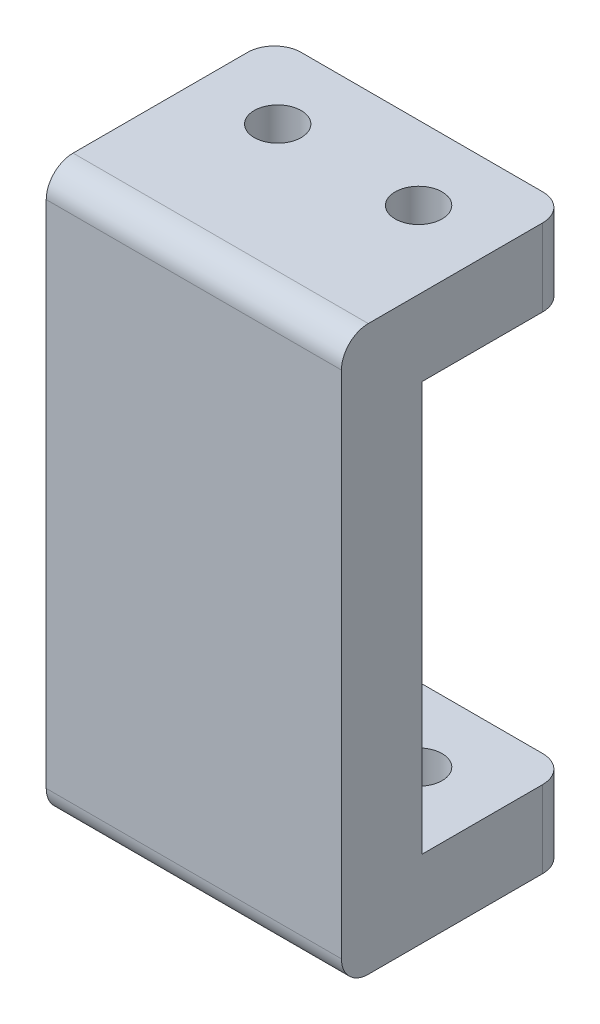
ISO-10303-21;
HEADER;
FILE_DESCRIPTION(('STEP AP214'),'2;1');
FILE_NAME('part.step','',(''),(''),'','','');
FILE_SCHEMA(('AUTOMOTIVE_DESIGN { 1 0 10303 214 1 1 1 1 }'));
ENDSEC;
DATA;
#1=APPLICATION_CONTEXT('core data for automotive mechanical design processes');
#2=APPLICATION_PROTOCOL_DEFINITION('international standard','automotive_design',2000,#1);
#3=PRODUCT_CONTEXT('',#1,'mechanical');
#4=PRODUCT('Part','Part','',(#3));
#5=PRODUCT_RELATED_PRODUCT_CATEGORY('part','',(#4));
#6=PRODUCT_DEFINITION_FORMATION('','',#4);
#7=PRODUCT_DEFINITION_CONTEXT('part definition',#1,'design');
#8=PRODUCT_DEFINITION('design','',#6,#7);
#9=PRODUCT_DEFINITION_SHAPE('','',#8);
#10=(LENGTH_UNIT() NAMED_UNIT(*) SI_UNIT(.MILLI.,.METRE.));
#11=(NAMED_UNIT(*) PLANE_ANGLE_UNIT() SI_UNIT($,.RADIAN.));
#12=(NAMED_UNIT(*) SI_UNIT($,.STERADIAN.) SOLID_ANGLE_UNIT());
#13=UNCERTAINTY_MEASURE_WITH_UNIT(LENGTH_MEASURE(1.E-05),#10,'distance_accuracy_value','');
#14=(GEOMETRIC_REPRESENTATION_CONTEXT(3) GLOBAL_UNCERTAINTY_ASSIGNED_CONTEXT((#13)) GLOBAL_UNIT_ASSIGNED_CONTEXT((#10,
#11,#12)) REPRESENTATION_CONTEXT('',''));
#15=CARTESIAN_POINT('',(0.,0.,0.));
#16=DIRECTION('',(0.,0.,1.));
#17=DIRECTION('',(1.,0.,0.));
#18=AXIS2_PLACEMENT_3D('',#15,#16,#17);
#19=CARTESIAN_POINT('',(0.,42.,-5.5));
#20=DIRECTION('',(0.,0.,-1.));
#21=DIRECTION('',(-1.,0.,0.));
#22=AXIS2_PLACEMENT_3D('',#19,#20,#21);
#23=PLANE('',#22);
#24=DIRECTION('',(1.,0.,0.));
#25=VECTOR('',#24,1.);
#26=CARTESIAN_POINT('',(0.,0.,-5.5));
#27=LINE('',#26,#25);
#28=CARTESIAN_POINT('',(-9.,0.,-5.5));
#29=VERTEX_POINT('',#28);
#30=CARTESIAN_POINT('',(9.,0.,-5.5));
#31=VERTEX_POINT('',#30);
#32=EDGE_CURVE('E207',#29,#31,#27,.T.);
#33=ORIENTED_EDGE('',*,*,#32,.F.);
#34=DIRECTION('',(0.,-1.,0.));
#35=VECTOR('',#34,1.);
#36=CARTESIAN_POINT('',(-9.,5.75,-5.5));
#37=LINE('',#36,#35);
#38=CARTESIAN_POINT('',(-9.,5.75,-5.5));
#39=VERTEX_POINT('',#38);
#40=EDGE_CURVE('E246',#29,#39,#37,.F.);
#41=ORIENTED_EDGE('',*,*,#40,.T.);
#42=DIRECTION('',(-1.,0.,0.));
#43=VECTOR('',#42,1.);
#44=CARTESIAN_POINT('',(11.,5.75,-5.5));
#45=LINE('',#44,#43);
#46=CARTESIAN_POINT('',(9.,5.75,-5.5));
#47=VERTEX_POINT('',#46);
#48=EDGE_CURVE('E176',#47,#39,#45,.T.);
#49=ORIENTED_EDGE('',*,*,#48,.F.);
#50=DIRECTION('',(0.,-1.,0.));
#51=VECTOR('',#50,1.);
#52=CARTESIAN_POINT('',(9.,42.,-5.5));
#53=LINE('',#52,#51);
#54=EDGE_CURVE('E243',#47,#31,#53,.T.);
#55=ORIENTED_EDGE('',*,*,#54,.T.);
#56=EDGE_LOOP('',(#33,#41,#49,#55));
#57=FACE_BOUND('',#56,.T.);
#58=ADVANCED_FACE('F37',(#57),#23,.T.);
#59=CARTESIAN_POINT('',(5.25,42.,0.));
#60=DIRECTION('',(0.,-1.,0.));
#61=DIRECTION('',(0.,0.,-1.));
#62=AXIS2_PLACEMENT_3D('',#59,#60,#61);
#63=CYLINDRICAL_SURFACE('',#62,1.75);
#64=CARTESIAN_POINT('',(5.25,5.75,0.));
#65=DIRECTION('',(0.,-1.,0.));
#66=DIRECTION('',(0.,0.,-1.));
#67=AXIS2_PLACEMENT_3D('',#64,#65,#66);
#68=CIRCLE('',#67,1.75);
#69=CARTESIAN_POINT('',(5.25,5.75,-1.75));
#70=VERTEX_POINT('',#69);
#71=EDGE_CURVE('E185',#70,#70,#68,.T.);
#72=ORIENTED_EDGE('',*,*,#71,.F.);
#73=EDGE_LOOP('',(#72));
#74=FACE_BOUND('',#73,.T.);
#75=CARTESIAN_POINT('',(5.25,0.,0.));
#76=DIRECTION('',(0.,1.,0.));
#77=DIRECTION('',(0.,0.,1.));
#78=AXIS2_PLACEMENT_3D('',#75,#76,#77);
#79=CIRCLE('',#78,1.75);
#80=CARTESIAN_POINT('',(5.25,0.,1.75));
#81=VERTEX_POINT('',#80);
#82=EDGE_CURVE('E213',#81,#81,#79,.T.);
#83=ORIENTED_EDGE('',*,*,#82,.F.);
#84=EDGE_LOOP('',(#83));
#85=FACE_BOUND('',#84,.T.);
#86=ADVANCED_FACE('F310',(#74,#85),#63,.F.);
#87=CARTESIAN_POINT('',(-5.25,42.,0.));
#88=DIRECTION('',(0.,-1.,0.));
#89=DIRECTION('',(0.,0.,-1.));
#90=AXIS2_PLACEMENT_3D('',#87,#88,#89);
#91=CYLINDRICAL_SURFACE('',#90,1.75);
#92=CARTESIAN_POINT('',(-5.25,5.75,0.));
#93=DIRECTION('',(0.,-1.,0.));
#94=DIRECTION('',(0.,0.,-1.));
#95=AXIS2_PLACEMENT_3D('',#92,#93,#94);
#96=CIRCLE('',#95,1.75);
#97=CARTESIAN_POINT('',(-5.25,5.75,-1.75));
#98=VERTEX_POINT('',#97);
#99=EDGE_CURVE('E184',#98,#98,#96,.T.);
#100=ORIENTED_EDGE('',*,*,#99,.F.);
#101=EDGE_LOOP('',(#100));
#102=FACE_BOUND('',#101,.T.);
#103=CARTESIAN_POINT('',(-5.25,0.,0.));
#104=DIRECTION('',(0.,1.,0.));
#105=DIRECTION('',(0.,0.,1.));
#106=AXIS2_PLACEMENT_3D('',#103,#104,#105);
#107=CIRCLE('',#106,1.75);
#108=CARTESIAN_POINT('',(-5.25,0.,1.75));
#109=VERTEX_POINT('',#108);
#110=EDGE_CURVE('E193',#109,#109,#107,.T.);
#111=ORIENTED_EDGE('',*,*,#110,.F.);
#112=EDGE_LOOP('',(#111));
#113=FACE_BOUND('',#112,.T.);
#114=ADVANCED_FACE('F316',(#102,#113),#91,.F.);
#115=CARTESIAN_POINT('',(11.,42.,0.));
#116=DIRECTION('',(1.,0.,0.));
#117=DIRECTION('',(0.,0.,-1.));
#118=AXIS2_PLACEMENT_3D('',#115,#116,#117);
#119=PLANE('',#118);
#120=DIRECTION('',(0.,0.,1.));
#121=VECTOR('',#120,1.);
#122=CARTESIAN_POINT('',(11.,0.,0.));
#123=LINE('',#122,#121);
#124=CARTESIAN_POINT('',(11.,0.,-3.5));
#125=VERTEX_POINT('',#124);
#126=CARTESIAN_POINT('',(11.,0.,9.5));
#127=VERTEX_POINT('',#126);
#128=EDGE_CURVE('E188',#125,#127,#123,.T.);
#129=ORIENTED_EDGE('',*,*,#128,.F.);
#130=DIRECTION('',(0.,-1.,0.));
#131=VECTOR('',#130,1.);
#132=CARTESIAN_POINT('',(11.,42.,-3.5));
#133=LINE('',#132,#131);
#134=CARTESIAN_POINT('',(11.,5.75,-3.5));
#135=VERTEX_POINT('',#134);
#136=EDGE_CURVE('E258',#125,#135,#133,.F.);
#137=ORIENTED_EDGE('',*,*,#136,.T.);
#138=DIRECTION('',(0.,0.,-1.));
#139=VECTOR('',#138,1.);
#140=CARTESIAN_POINT('',(11.,5.75,49.1065153929475));
#141=LINE('',#140,#139);
#142=CARTESIAN_POINT('',(11.,5.75000000000001,5.5));
#143=VERTEX_POINT('',#142);
#144=EDGE_CURVE('E149',#143,#135,#141,.T.);
#145=ORIENTED_EDGE('',*,*,#144,.F.);
#146=DIRECTION('',(0.,1.,0.));
#147=VECTOR('',#146,1.);
#148=CARTESIAN_POINT('',(11.,36.25,5.5));
#149=LINE('',#148,#147);
#150=CARTESIAN_POINT('',(11.,36.25,5.5));
#151=VERTEX_POINT('',#150);
#152=EDGE_CURVE('E156',#143,#151,#149,.T.);
#153=ORIENTED_EDGE('',*,*,#152,.T.);
#154=DIRECTION('',(0.,0.,-1.));
#155=VECTOR('',#154,1.);
#156=CARTESIAN_POINT('',(11.,36.25,49.1065153929475));
#157=LINE('',#156,#155);
#158=CARTESIAN_POINT('',(11.,36.25,-3.5));
#159=VERTEX_POINT('',#158);
#160=EDGE_CURVE('E138',#151,#159,#157,.T.);
#161=ORIENTED_EDGE('',*,*,#160,.T.);
#162=DIRECTION('',(0.,-1.,0.));
#163=VECTOR('',#162,1.);
#164=CARTESIAN_POINT('',(11.,42.,-3.5));
#165=LINE('',#164,#163);
#166=CARTESIAN_POINT('',(11.,42.,-3.5));
#167=VERTEX_POINT('',#166);
#168=EDGE_CURVE('E256',#159,#167,#165,.F.);
#169=ORIENTED_EDGE('',*,*,#168,.T.);
#170=DIRECTION('',(0.,0.,1.));
#171=VECTOR('',#170,1.);
#172=CARTESIAN_POINT('',(11.,42.,0.));
#173=LINE('',#172,#171);
#174=CARTESIAN_POINT('',(11.,42.,9.5));
#175=VERTEX_POINT('',#174);
#176=EDGE_CURVE('E189',#167,#175,#173,.T.);
#177=ORIENTED_EDGE('',*,*,#176,.T.);
#178=CARTESIAN_POINT('',(11.,40.,9.5));
#179=DIRECTION('',(1.,0.,0.));
#180=DIRECTION('',(0.,0.,-1.));
#181=AXIS2_PLACEMENT_3D('',#178,#179,#180);
#182=CIRCLE('',#181,2.);
#183=CARTESIAN_POINT('',(11.,40.,11.5));
#184=VERTEX_POINT('',#183);
#185=EDGE_CURVE('E254',#175,#184,#182,.T.);
#186=ORIENTED_EDGE('',*,*,#185,.T.);
#187=DIRECTION('',(0.,-1.,0.));
#188=VECTOR('',#187,1.);
#189=CARTESIAN_POINT('',(11.,42.,11.5));
#190=LINE('',#189,#188);
#191=CARTESIAN_POINT('',(11.,2.00000000000002,11.5));
#192=VERTEX_POINT('',#191);
#193=EDGE_CURVE('E204',#184,#192,#190,.T.);
#194=ORIENTED_EDGE('',*,*,#193,.T.);
#195=CARTESIAN_POINT('',(11.,2.,9.5));
#196=DIRECTION('',(1.,0.,0.));
#197=DIRECTION('',(0.,0.,-1.));
#198=AXIS2_PLACEMENT_3D('',#195,#196,#197);
#199=CIRCLE('',#198,2.);
#200=EDGE_CURVE('E252',#192,#127,#199,.T.);
#201=ORIENTED_EDGE('',*,*,#200,.T.);
#202=EDGE_LOOP('',(#129,#137,#145,#153,#161,#169,#177,#186,#194,#201));
#203=FACE_BOUND('',#202,.T.);
#204=ADVANCED_FACE('F164',(#203),#119,.T.);
#205=DIRECTION('',(1.,0.,0.));
#206=VECTOR('',#205,1.);
#207=CARTESIAN_POINT('',(0.,42.,-5.5));
#208=LINE('',#207,#206);
#209=CARTESIAN_POINT('',(-9.,42.,-5.5));
#210=VERTEX_POINT('',#209);
#211=CARTESIAN_POINT('',(9.,42.,-5.5));
#212=VERTEX_POINT('',#211);
#213=EDGE_CURVE('E192',#210,#212,#208,.T.);
#214=ORIENTED_EDGE('',*,*,#213,.T.);
#215=DIRECTION('',(0.,-1.,0.));
#216=VECTOR('',#215,1.);
#217=CARTESIAN_POINT('',(9.,42.,-5.5));
#218=LINE('',#217,#216);
#219=CARTESIAN_POINT('',(9.,36.25,-5.5));
#220=VERTEX_POINT('',#219);
#221=EDGE_CURVE('E261',#212,#220,#218,.T.);
#222=ORIENTED_EDGE('',*,*,#221,.T.);
#223=DIRECTION('',(1.,0.,0.));
#224=VECTOR('',#223,1.);
#225=CARTESIAN_POINT('',(11.,36.25,-5.5));
#226=LINE('',#225,#224);
#227=CARTESIAN_POINT('',(-9.,36.25,-5.5));
#228=VERTEX_POINT('',#227);
#229=EDGE_CURVE('E174',#228,#220,#226,.T.);
#230=ORIENTED_EDGE('',*,*,#229,.F.);
#231=DIRECTION('',(0.,-1.,0.));
#232=VECTOR('',#231,1.);
#233=CARTESIAN_POINT('',(-9.,42.,-5.5));
#234=LINE('',#233,#232);
#235=EDGE_CURVE('E59',#228,#210,#234,.F.);
#236=ORIENTED_EDGE('',*,*,#235,.T.);
#237=EDGE_LOOP('',(#214,#222,#230,#236));
#238=FACE_BOUND('',#237,.T.);
#239=ADVANCED_FACE('F294',(#238),#23,.T.);
#240=CARTESIAN_POINT('',(-11.,42.,0.));
#241=DIRECTION('',(1.,0.,0.));
#242=DIRECTION('',(0.,0.,-1.));
#243=AXIS2_PLACEMENT_3D('',#240,#241,#242);
#244=PLANE('',#243);
#245=DIRECTION('',(0.,0.,-1.));
#246=VECTOR('',#245,1.);
#247=CARTESIAN_POINT('',(-11.,5.75,49.1065153929475));
#248=LINE('',#247,#246);
#249=CARTESIAN_POINT('',(-11.,5.75000000000001,5.5));
#250=VERTEX_POINT('',#249);
#251=CARTESIAN_POINT('',(-11.,5.75,-3.5));
#252=VERTEX_POINT('',#251);
#253=EDGE_CURVE('E167',#250,#252,#248,.T.);
#254=ORIENTED_EDGE('',*,*,#253,.T.);
#255=DIRECTION('',(0.,-1.,0.));
#256=VECTOR('',#255,1.);
#257=CARTESIAN_POINT('',(-11.,0.,-3.5));
#258=LINE('',#257,#256);
#259=CARTESIAN_POINT('',(-11.,0.,-3.5));
#260=VERTEX_POINT('',#259);
#261=EDGE_CURVE('E234',#252,#260,#258,.T.);
#262=ORIENTED_EDGE('',*,*,#261,.T.);
#263=DIRECTION('',(0.,0.,1.));
#264=VECTOR('',#263,1.);
#265=CARTESIAN_POINT('',(-11.,0.,0.));
#266=LINE('',#265,#264);
#267=CARTESIAN_POINT('',(-11.,0.,9.5));
#268=VERTEX_POINT('',#267);
#269=EDGE_CURVE('E210',#260,#268,#266,.T.);
#270=ORIENTED_EDGE('',*,*,#269,.T.);
#271=CARTESIAN_POINT('',(-11.,2.,9.5));
#272=DIRECTION('',(1.,0.,0.));
#273=DIRECTION('',(0.,0.,-1.));
#274=AXIS2_PLACEMENT_3D('',#271,#272,#273);
#275=CIRCLE('',#274,2.);
#276=CARTESIAN_POINT('',(-11.,2.00000000000002,11.5));
#277=VERTEX_POINT('',#276);
#278=EDGE_CURVE('E223',#268,#277,#275,.F.);
#279=ORIENTED_EDGE('',*,*,#278,.T.);
#280=DIRECTION('',(0.,-1.,0.));
#281=VECTOR('',#280,1.);
#282=CARTESIAN_POINT('',(-11.,42.,11.5));
#283=LINE('',#282,#281);
#284=CARTESIAN_POINT('',(-11.,40.,11.5));
#285=VERTEX_POINT('',#284);
#286=EDGE_CURVE('E220',#285,#277,#283,.T.);
#287=ORIENTED_EDGE('',*,*,#286,.F.);
#288=CARTESIAN_POINT('',(-11.,40.,9.5));
#289=DIRECTION('',(1.,0.,0.));
#290=DIRECTION('',(0.,0.,-1.));
#291=AXIS2_PLACEMENT_3D('',#288,#289,#290);
#292=CIRCLE('',#291,2.);
#293=CARTESIAN_POINT('',(-11.,42.,9.5));
#294=VERTEX_POINT('',#293);
#295=EDGE_CURVE('E229',#285,#294,#292,.F.);
#296=ORIENTED_EDGE('',*,*,#295,.T.);
#297=DIRECTION('',(0.,0.,1.));
#298=VECTOR('',#297,1.);
#299=CARTESIAN_POINT('',(-11.,42.,0.));
#300=LINE('',#299,#298);
#301=CARTESIAN_POINT('',(-11.,42.,-3.5));
#302=VERTEX_POINT('',#301);
#303=EDGE_CURVE('E195',#302,#294,#300,.T.);
#304=ORIENTED_EDGE('',*,*,#303,.F.);
#305=DIRECTION('',(0.,-1.,0.));
#306=VECTOR('',#305,1.);
#307=CARTESIAN_POINT('',(-11.,36.25,-3.5));
#308=LINE('',#307,#306);
#309=CARTESIAN_POINT('',(-11.,36.25,-3.5));
#310=VERTEX_POINT('',#309);
#311=EDGE_CURVE('E231',#302,#310,#308,.T.);
#312=ORIENTED_EDGE('',*,*,#311,.T.);
#313=DIRECTION('',(0.,0.,-1.));
#314=VECTOR('',#313,1.);
#315=CARTESIAN_POINT('',(-11.,36.25,49.1065153929475));
#316=LINE('',#315,#314);
#317=CARTESIAN_POINT('',(-11.,36.25,5.5));
#318=VERTEX_POINT('',#317);
#319=EDGE_CURVE('E150',#318,#310,#316,.T.);
#320=ORIENTED_EDGE('',*,*,#319,.F.);
#321=DIRECTION('',(0.,-1.,0.));
#322=VECTOR('',#321,1.);
#323=CARTESIAN_POINT('',(-11.,36.25,5.5));
#324=LINE('',#323,#322);
#325=EDGE_CURVE('E159',#318,#250,#324,.T.);
#326=ORIENTED_EDGE('',*,*,#325,.T.);
#327=EDGE_LOOP('',(#254,#262,#270,#279,#287,#296,#304,#312,#320,#326));
#328=FACE_BOUND('',#327,.T.);
#329=ADVANCED_FACE('F291',(#328),#244,.F.);
#330=CARTESIAN_POINT('',(5.25,36.25,0.));
#331=DIRECTION('',(0.,1.,0.));
#332=DIRECTION('',(0.,0.,1.));
#333=AXIS2_PLACEMENT_3D('',#330,#331,#332);
#334=CIRCLE('',#333,1.75);
#335=CARTESIAN_POINT('',(5.25,36.25,1.75));
#336=VERTEX_POINT('',#335);
#337=EDGE_CURVE('E181',#336,#336,#334,.T.);
#338=ORIENTED_EDGE('',*,*,#337,.F.);
#339=EDGE_LOOP('',(#338));
#340=FACE_BOUND('',#339,.T.);
#341=CARTESIAN_POINT('',(5.25,42.,0.));
#342=DIRECTION('',(0.,1.,0.));
#343=DIRECTION('',(0.,0.,1.));
#344=AXIS2_PLACEMENT_3D('',#341,#342,#343);
#345=CIRCLE('',#344,1.75);
#346=CARTESIAN_POINT('',(5.25,42.,1.75));
#347=VERTEX_POINT('',#346);
#348=EDGE_CURVE('E198',#347,#347,#345,.T.);
#349=ORIENTED_EDGE('',*,*,#348,.T.);
#350=EDGE_LOOP('',(#349));
#351=FACE_BOUND('',#350,.T.);
#352=ADVANCED_FACE('F319',(#340,#351),#63,.F.);
#353=CARTESIAN_POINT('',(0.,42.,11.5));
#354=DIRECTION('',(0.,0.,-1.));
#355=DIRECTION('',(-1.,0.,0.));
#356=AXIS2_PLACEMENT_3D('',#353,#354,#355);
#357=PLANE('',#356);
#358=ORIENTED_EDGE('',*,*,#193,.F.);
#359=DIRECTION('',(1.,0.,0.));
#360=VECTOR('',#359,1.);
#361=CARTESIAN_POINT('',(-11.,40.,11.5));
#362=LINE('',#361,#360);
#363=EDGE_CURVE('E12',#184,#285,#362,.F.);
#364=ORIENTED_EDGE('',*,*,#363,.T.);
#365=ORIENTED_EDGE('',*,*,#286,.T.);
#366=DIRECTION('',(1.,0.,0.));
#367=VECTOR('',#366,1.);
#368=CARTESIAN_POINT('',(0.,2.,11.5));
#369=LINE('',#368,#367);
#370=EDGE_CURVE('E45',#277,#192,#369,.T.);
#371=ORIENTED_EDGE('',*,*,#370,.T.);
#372=EDGE_LOOP('',(#358,#364,#365,#371));
#373=FACE_BOUND('',#372,.T.);
#374=ADVANCED_FACE('F276',(#373),#357,.F.);
#375=CARTESIAN_POINT('',(-5.25,36.25,0.));
#376=DIRECTION('',(0.,1.,0.));
#377=DIRECTION('',(0.,0.,1.));
#378=AXIS2_PLACEMENT_3D('',#375,#376,#377);
#379=CIRCLE('',#378,1.75);
#380=CARTESIAN_POINT('',(-5.25,36.25,1.75));
#381=VERTEX_POINT('',#380);
#382=EDGE_CURVE('E161',#381,#381,#379,.T.);
#383=ORIENTED_EDGE('',*,*,#382,.F.);
#384=EDGE_LOOP('',(#383));
#385=FACE_BOUND('',#384,.T.);
#386=CARTESIAN_POINT('',(-5.25,42.,0.));
#387=DIRECTION('',(0.,1.,0.));
#388=DIRECTION('',(0.,0.,1.));
#389=AXIS2_PLACEMENT_3D('',#386,#387,#388);
#390=CIRCLE('',#389,1.75);
#391=CARTESIAN_POINT('',(-5.25,42.,1.75));
#392=VERTEX_POINT('',#391);
#393=EDGE_CURVE('E201',#392,#392,#390,.T.);
#394=ORIENTED_EDGE('',*,*,#393,.T.);
#395=EDGE_LOOP('',(#394));
#396=FACE_BOUND('',#395,.T.);
#397=ADVANCED_FACE('F333',(#385,#396),#91,.F.);
#398=CARTESIAN_POINT('',(0.,42.,0.));
#399=DIRECTION('',(0.,1.,0.));
#400=DIRECTION('',(0.,0.,1.));
#401=AXIS2_PLACEMENT_3D('',#398,#399,#400);
#402=PLANE('',#401);
#403=ORIENTED_EDGE('',*,*,#176,.F.);
#404=CARTESIAN_POINT('',(9.,42.,-3.5));
#405=DIRECTION('',(0.,1.,0.));
#406=DIRECTION('',(0.,0.,1.));
#407=AXIS2_PLACEMENT_3D('',#404,#405,#406);
#408=CIRCLE('',#407,2.);
#409=EDGE_CURVE('E52',#167,#212,#408,.T.);
#410=ORIENTED_EDGE('',*,*,#409,.T.);
#411=ORIENTED_EDGE('',*,*,#213,.F.);
#412=CARTESIAN_POINT('',(-9.,42.,-3.5));
#413=DIRECTION('',(0.,1.,0.));
#414=DIRECTION('',(0.,0.,1.));
#415=AXIS2_PLACEMENT_3D('',#412,#413,#414);
#416=CIRCLE('',#415,2.);
#417=EDGE_CURVE('E270',#210,#302,#416,.T.);
#418=ORIENTED_EDGE('',*,*,#417,.T.);
#419=ORIENTED_EDGE('',*,*,#303,.T.);
#420=DIRECTION('',(1.,0.,0.));
#421=VECTOR('',#420,1.);
#422=CARTESIAN_POINT('',(11.,42.,9.5));
#423=LINE('',#422,#421);
#424=EDGE_CURVE('E267',#294,#175,#423,.T.);
#425=ORIENTED_EDGE('',*,*,#424,.T.);
#426=EDGE_LOOP('',(#403,#410,#411,#418,#419,#425));
#427=FACE_BOUND('',#426,.T.);
#428=ORIENTED_EDGE('',*,*,#348,.F.);
#429=EDGE_LOOP('',(#428));
#430=FACE_BOUND('',#429,.T.);
#431=ORIENTED_EDGE('',*,*,#393,.F.);
#432=EDGE_LOOP('',(#431));
#433=FACE_BOUND('',#432,.T.);
#434=ADVANCED_FACE('F285',(#427,#430,#433),#402,.T.);
#435=CARTESIAN_POINT('',(0.,0.,0.));
#436=DIRECTION('',(0.,1.,0.));
#437=DIRECTION('',(0.,0.,1.));
#438=AXIS2_PLACEMENT_3D('',#435,#436,#437);
#439=PLANE('',#438);
#440=ORIENTED_EDGE('',*,*,#269,.F.);
#441=CARTESIAN_POINT('',(-9.,0.,-3.5));
#442=DIRECTION('',(0.,1.,0.));
#443=DIRECTION('',(0.,0.,1.));
#444=AXIS2_PLACEMENT_3D('',#441,#442,#443);
#445=CIRCLE('',#444,2.);
#446=EDGE_CURVE('E241',#260,#29,#445,.F.);
#447=ORIENTED_EDGE('',*,*,#446,.T.);
#448=ORIENTED_EDGE('',*,*,#32,.T.);
#449=CARTESIAN_POINT('',(9.,0.,-3.5));
#450=DIRECTION('',(0.,1.,0.));
#451=DIRECTION('',(0.,0.,1.));
#452=AXIS2_PLACEMENT_3D('',#449,#450,#451);
#453=CIRCLE('',#452,2.);
#454=EDGE_CURVE('E239',#31,#125,#453,.F.);
#455=ORIENTED_EDGE('',*,*,#454,.T.);
#456=ORIENTED_EDGE('',*,*,#128,.T.);
#457=DIRECTION('',(1.,0.,0.));
#458=VECTOR('',#457,1.);
#459=CARTESIAN_POINT('',(0.,0.,9.5));
#460=LINE('',#459,#458);
#461=EDGE_CURVE('E237',#127,#268,#460,.F.);
#462=ORIENTED_EDGE('',*,*,#461,.T.);
#463=EDGE_LOOP('',(#440,#447,#448,#455,#456,#462));
#464=FACE_BOUND('',#463,.T.);
#465=ORIENTED_EDGE('',*,*,#82,.T.);
#466=EDGE_LOOP('',(#465));
#467=FACE_BOUND('',#466,.T.);
#468=ORIENTED_EDGE('',*,*,#110,.T.);
#469=EDGE_LOOP('',(#468));
#470=FACE_BOUND('',#469,.T.);
#471=ADVANCED_FACE('F349',(#464,#467,#470),#439,.F.);
#472=CARTESIAN_POINT('',(11.,5.75,49.1065153929475));
#473=DIRECTION('',(0.,-1.,0.));
#474=DIRECTION('',(0.,0.,-1.));
#475=AXIS2_PLACEMENT_3D('',#472,#473,#474);
#476=PLANE('',#475);
#477=ORIENTED_EDGE('',*,*,#71,.T.);
#478=EDGE_LOOP('',(#477));
#479=FACE_BOUND('',#478,.T.);
#480=ORIENTED_EDGE('',*,*,#99,.T.);
#481=EDGE_LOOP('',(#480));
#482=FACE_BOUND('',#481,.T.);
#483=ORIENTED_EDGE('',*,*,#48,.T.);
#484=CARTESIAN_POINT('',(-9.,5.75,-3.5));
#485=DIRECTION('',(0.,-1.,0.));
#486=DIRECTION('',(0.,0.,-1.));
#487=AXIS2_PLACEMENT_3D('',#484,#485,#486);
#488=CIRCLE('',#487,2.);
#489=EDGE_CURVE('E250',#39,#252,#488,.F.);
#490=ORIENTED_EDGE('',*,*,#489,.T.);
#491=ORIENTED_EDGE('',*,*,#253,.F.);
#492=DIRECTION('',(1.,0.,0.));
#493=VECTOR('',#492,1.);
#494=CARTESIAN_POINT('',(11.,5.75,5.5));
#495=LINE('',#494,#493);
#496=EDGE_CURVE('E166',#250,#143,#495,.T.);
#497=ORIENTED_EDGE('',*,*,#496,.T.);
#498=ORIENTED_EDGE('',*,*,#144,.T.);
#499=CARTESIAN_POINT('',(9.,5.75,-3.5));
#500=DIRECTION('',(0.,-1.,0.));
#501=DIRECTION('',(0.,0.,-1.));
#502=AXIS2_PLACEMENT_3D('',#499,#500,#501);
#503=CIRCLE('',#502,2.);
#504=EDGE_CURVE('E248',#135,#47,#503,.F.);
#505=ORIENTED_EDGE('',*,*,#504,.T.);
#506=EDGE_LOOP('',(#483,#490,#491,#497,#498,#505));
#507=FACE_BOUND('',#506,.T.);
#508=ADVANCED_FACE('F345',(#479,#482,#507),#476,.F.);
#509=CARTESIAN_POINT('',(11.,36.25,49.1065153929475));
#510=DIRECTION('',(0.,1.,0.));
#511=DIRECTION('',(0.,0.,1.));
#512=AXIS2_PLACEMENT_3D('',#509,#510,#511);
#513=PLANE('',#512);
#514=ORIENTED_EDGE('',*,*,#337,.T.);
#515=EDGE_LOOP('',(#514));
#516=FACE_BOUND('',#515,.T.);
#517=ORIENTED_EDGE('',*,*,#382,.T.);
#518=EDGE_LOOP('',(#517));
#519=FACE_BOUND('',#518,.T.);
#520=ORIENTED_EDGE('',*,*,#229,.T.);
#521=CARTESIAN_POINT('',(9.,36.25,-3.5));
#522=DIRECTION('',(0.,1.,0.));
#523=DIRECTION('',(0.,0.,1.));
#524=AXIS2_PLACEMENT_3D('',#521,#522,#523);
#525=CIRCLE('',#524,2.);
#526=EDGE_CURVE('E145',#220,#159,#525,.F.);
#527=ORIENTED_EDGE('',*,*,#526,.T.);
#528=ORIENTED_EDGE('',*,*,#160,.F.);
#529=DIRECTION('',(-1.,0.,0.));
#530=VECTOR('',#529,1.);
#531=CARTESIAN_POINT('',(11.,36.25,5.5));
#532=LINE('',#531,#530);
#533=EDGE_CURVE('E143',#151,#318,#532,.T.);
#534=ORIENTED_EDGE('',*,*,#533,.T.);
#535=ORIENTED_EDGE('',*,*,#319,.T.);
#536=CARTESIAN_POINT('',(-9.,36.25,-3.5));
#537=DIRECTION('',(0.,1.,0.));
#538=DIRECTION('',(0.,0.,1.));
#539=AXIS2_PLACEMENT_3D('',#536,#537,#538);
#540=CIRCLE('',#539,2.);
#541=EDGE_CURVE('E264',#310,#228,#540,.F.);
#542=ORIENTED_EDGE('',*,*,#541,.T.);
#543=EDGE_LOOP('',(#520,#527,#528,#534,#535,#542));
#544=FACE_BOUND('',#543,.T.);
#545=ADVANCED_FACE('F141',(#516,#519,#544),#513,.F.);
#546=CARTESIAN_POINT('',(0.,42.,5.5));
#547=DIRECTION('',(0.,0.,-1.));
#548=DIRECTION('',(-1.,0.,0.));
#549=AXIS2_PLACEMENT_3D('',#546,#547,#548);
#550=PLANE('',#549);
#551=ORIENTED_EDGE('',*,*,#325,.F.);
#552=ORIENTED_EDGE('',*,*,#533,.F.);
#553=ORIENTED_EDGE('',*,*,#152,.F.);
#554=ORIENTED_EDGE('',*,*,#496,.F.);
#555=EDGE_LOOP('',(#551,#552,#553,#554));
#556=FACE_BOUND('',#555,.T.);
#557=ADVANCED_FACE('F154',(#556),#550,.T.);
#558=CARTESIAN_POINT('',(-9.,42.,-3.5));
#559=DIRECTION('',(0.,1.,0.));
#560=DIRECTION('',(0.,0.,1.));
#561=AXIS2_PLACEMENT_3D('',#558,#559,#560);
#562=CYLINDRICAL_SURFACE('',#561,2.);
#563=ORIENTED_EDGE('',*,*,#489,.F.);
#564=ORIENTED_EDGE('',*,*,#40,.F.);
#565=ORIENTED_EDGE('',*,*,#446,.F.);
#566=ORIENTED_EDGE('',*,*,#261,.F.);
#567=EDGE_LOOP('',(#563,#564,#565,#566));
#568=FACE_BOUND('',#567,.T.);
#569=ADVANCED_FACE('F306',(#568),#562,.T.);
#570=CARTESIAN_POINT('',(9.,42.,-3.5));
#571=DIRECTION('',(0.,-1.,0.));
#572=DIRECTION('',(0.,0.,-1.));
#573=AXIS2_PLACEMENT_3D('',#570,#571,#572);
#574=CYLINDRICAL_SURFACE('',#573,2.);
#575=ORIENTED_EDGE('',*,*,#504,.F.);
#576=ORIENTED_EDGE('',*,*,#136,.F.);
#577=ORIENTED_EDGE('',*,*,#454,.F.);
#578=ORIENTED_EDGE('',*,*,#54,.F.);
#579=EDGE_LOOP('',(#575,#576,#577,#578));
#580=FACE_BOUND('',#579,.T.);
#581=ADVANCED_FACE('F299',(#580),#574,.T.);
#582=CARTESIAN_POINT('',(9.,42.,-3.5));
#583=DIRECTION('',(0.,-1.,0.));
#584=DIRECTION('',(0.,0.,-1.));
#585=AXIS2_PLACEMENT_3D('',#582,#583,#584);
#586=CYLINDRICAL_SURFACE('',#585,2.);
#587=ORIENTED_EDGE('',*,*,#409,.F.);
#588=ORIENTED_EDGE('',*,*,#168,.F.);
#589=ORIENTED_EDGE('',*,*,#526,.F.);
#590=ORIENTED_EDGE('',*,*,#221,.F.);
#591=EDGE_LOOP('',(#587,#588,#589,#590));
#592=FACE_BOUND('',#591,.T.);
#593=ADVANCED_FACE('F297',(#592),#586,.T.);
#594=CARTESIAN_POINT('',(-9.,42.,-3.5));
#595=DIRECTION('',(0.,1.,0.));
#596=DIRECTION('',(0.,0.,1.));
#597=AXIS2_PLACEMENT_3D('',#594,#595,#596);
#598=CYLINDRICAL_SURFACE('',#597,2.);
#599=ORIENTED_EDGE('',*,*,#417,.F.);
#600=ORIENTED_EDGE('',*,*,#235,.F.);
#601=ORIENTED_EDGE('',*,*,#541,.F.);
#602=ORIENTED_EDGE('',*,*,#311,.F.);
#603=EDGE_LOOP('',(#599,#600,#601,#602));
#604=FACE_BOUND('',#603,.T.);
#605=ADVANCED_FACE('F293',(#604),#598,.T.);
#606=CARTESIAN_POINT('',(0.,40.,9.5));
#607=DIRECTION('',(-1.,0.,0.));
#608=DIRECTION('',(0.,0.,1.));
#609=AXIS2_PLACEMENT_3D('',#606,#607,#608);
#610=CYLINDRICAL_SURFACE('',#609,2.);
#611=ORIENTED_EDGE('',*,*,#295,.F.);
#612=ORIENTED_EDGE('',*,*,#363,.F.);
#613=ORIENTED_EDGE('',*,*,#185,.F.);
#614=ORIENTED_EDGE('',*,*,#424,.F.);
#615=EDGE_LOOP('',(#611,#612,#613,#614));
#616=FACE_BOUND('',#615,.T.);
#617=ADVANCED_FACE('F284',(#616),#610,.T.);
#618=CARTESIAN_POINT('',(0.,2.,9.5));
#619=DIRECTION('',(1.,0.,0.));
#620=DIRECTION('',(0.,0.,-1.));
#621=AXIS2_PLACEMENT_3D('',#618,#619,#620);
#622=CYLINDRICAL_SURFACE('',#621,2.);
#623=ORIENTED_EDGE('',*,*,#278,.F.);
#624=ORIENTED_EDGE('',*,*,#461,.F.);
#625=ORIENTED_EDGE('',*,*,#200,.F.);
#626=ORIENTED_EDGE('',*,*,#370,.F.);
#627=EDGE_LOOP('',(#623,#624,#625,#626));
#628=FACE_BOUND('',#627,.T.);
#629=ADVANCED_FACE('F39',(#628),#622,.T.);
#630=CLOSED_SHELL('',(#58,#86,#114,#204,#239,#329,#352,#374,#397,#434,#471,#508,#545,#557,#569,
#581,#593,#605,#617,#629));
#631=MANIFOLD_SOLID_BREP('B2',#630);
#632=ADVANCED_BREP_SHAPE_REPRESENTATION('',(#18,#631),#14);
#633=SHAPE_DEFINITION_REPRESENTATION(#9,#632);
ENDSEC;
END-ISO-10303-21;
